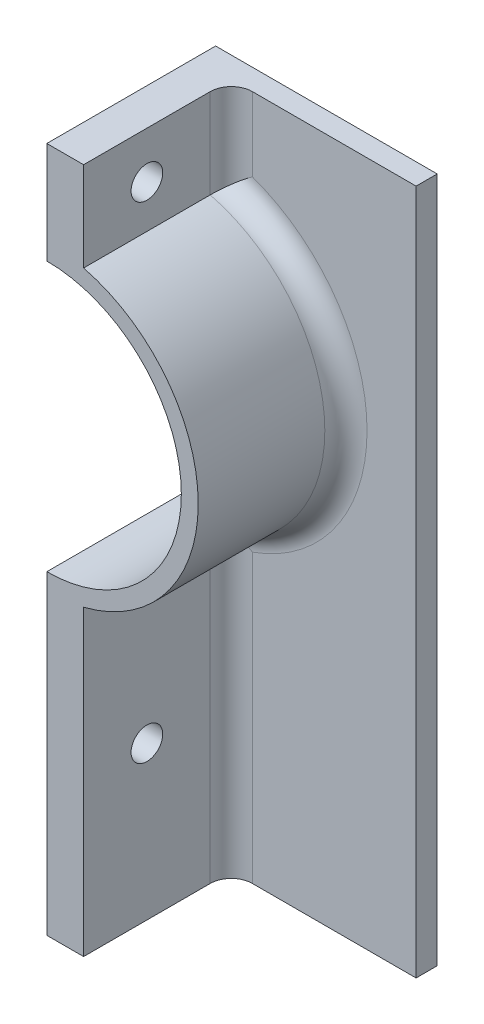
ISO-10303-21;
HEADER;
FILE_DESCRIPTION(('STEP AP214'),'2;1');
FILE_NAME('part.step','',(''),(''),'','','');
FILE_SCHEMA(('AUTOMOTIVE_DESIGN { 1 0 10303 214 1 1 1 1 }'));
ENDSEC;
DATA;
#1=APPLICATION_CONTEXT('core data for automotive mechanical design processes');
#2=APPLICATION_PROTOCOL_DEFINITION('international standard','automotive_design',2000,#1);
#3=PRODUCT_CONTEXT('',#1,'mechanical');
#4=PRODUCT('Part','Part','',(#3));
#5=PRODUCT_RELATED_PRODUCT_CATEGORY('part','',(#4));
#6=PRODUCT_DEFINITION_FORMATION('','',#4);
#7=PRODUCT_DEFINITION_CONTEXT('part definition',#1,'design');
#8=PRODUCT_DEFINITION('design','',#6,#7);
#9=PRODUCT_DEFINITION_SHAPE('','',#8);
#10=(LENGTH_UNIT() NAMED_UNIT(*) SI_UNIT(.MILLI.,.METRE.));
#11=(NAMED_UNIT(*) PLANE_ANGLE_UNIT() SI_UNIT($,.RADIAN.));
#12=(NAMED_UNIT(*) SI_UNIT($,.STERADIAN.) SOLID_ANGLE_UNIT());
#13=UNCERTAINTY_MEASURE_WITH_UNIT(LENGTH_MEASURE(1.E-05),#10,'distance_accuracy_value','');
#14=(GEOMETRIC_REPRESENTATION_CONTEXT(3) GLOBAL_UNCERTAINTY_ASSIGNED_CONTEXT((#13)) GLOBAL_UNIT_ASSIGNED_CONTEXT((#10,
#11,#12)) REPRESENTATION_CONTEXT('',''));
#15=CARTESIAN_POINT('',(0.,0.,0.));
#16=DIRECTION('',(0.,0.,1.));
#17=DIRECTION('',(1.,0.,0.));
#18=AXIS2_PLACEMENT_3D('',#15,#16,#17);
#19=CARTESIAN_POINT('',(28.5577576169837,0.,20.32));
#20=DIRECTION('',(-1.,0.,0.));
#21=DIRECTION('',(0.,0.,1.));
#22=AXIS2_PLACEMENT_3D('',#19,#20,#21);
#23=PLANE('',#22);
#24=CARTESIAN_POINT('',(28.5577576169837,18.4308896178761,12.7));
#25=DIRECTION('',(-1.,0.,0.));
#26=DIRECTION('',(0.,0.,1.));
#27=AXIS2_PLACEMENT_3D('',#24,#25,#26);
#28=CIRCLE('',#27,1.905);
#29=CARTESIAN_POINT('',(28.5577576169837,18.4308896178761,14.605));
#30=VERTEX_POINT('',#29);
#31=EDGE_CURVE('E345',#30,#30,#28,.F.);
#32=ORIENTED_EDGE('',*,*,#31,.F.);
#33=EDGE_LOOP('',(#32));
#34=FACE_BOUND('',#33,.T.);
#35=DIRECTION('',(0.,0.,-1.));
#36=VECTOR('',#35,1.);
#37=CARTESIAN_POINT('',(28.5577576169837,0.,20.32));
#38=LINE('',#37,#36);
#39=CARTESIAN_POINT('',(28.5577576169837,0.,20.32));
#40=VERTEX_POINT('',#39);
#41=CARTESIAN_POINT('',(28.5577576169837,0.,5.08));
#42=VERTEX_POINT('',#41);
#43=EDGE_CURVE('E206',#40,#42,#38,.T.);
#44=ORIENTED_EDGE('',*,*,#43,.T.);
#45=DIRECTION('',(0.,1.,0.));
#46=VECTOR('',#45,1.);
#47=CARTESIAN_POINT('',(28.5577576169837,0.,5.08));
#48=LINE('',#47,#46);
#49=CARTESIAN_POINT('',(28.5577576169837,36.4235565522515,5.08));
#50=VERTEX_POINT('',#49);
#51=EDGE_CURVE('E244',#42,#50,#48,.T.);
#52=ORIENTED_EDGE('',*,*,#51,.T.);
#53=DIRECTION('',(0.,0.,-1.));
#54=VECTOR('',#53,1.);
#55=CARTESIAN_POINT('',(28.5577576169837,36.4235565522515,20.32));
#56=LINE('',#55,#54);
#57=CARTESIAN_POINT('',(28.5577576169837,36.4235565522515,20.32));
#58=VERTEX_POINT('',#57);
#59=EDGE_CURVE('E241',#58,#50,#56,.T.);
#60=ORIENTED_EDGE('',*,*,#59,.F.);
#61=DIRECTION('',(0.,1.,0.));
#62=VECTOR('',#61,1.);
#63=CARTESIAN_POINT('',(28.5577576169837,0.,20.32));
#64=LINE('',#63,#62);
#65=EDGE_CURVE('E179',#40,#58,#64,.T.);
#66=ORIENTED_EDGE('',*,*,#65,.F.);
#67=EDGE_LOOP('',(#44,#52,#60,#66));
#68=FACE_BOUND('',#67,.T.);
#69=ADVANCED_FACE('F45',(#34,#68),#23,.F.);
#70=CARTESIAN_POINT('',(24.13,54.102,20.32));
#71=DIRECTION('',(0.,0.,-1.));
#72=DIRECTION('',(-1.,0.,0.));
#73=AXIS2_PLACEMENT_3D('',#70,#71,#72);
#74=CYLINDRICAL_SURFACE('',#73,18.2245);
#75=ORIENTED_EDGE('',*,*,#59,.T.);
#76=CARTESIAN_POINT('',(24.13,54.102,5.08));
#77=DIRECTION('',(0.,0.,1.));
#78=DIRECTION('',(1.,0.,0.));
#79=AXIS2_PLACEMENT_3D('',#76,#77,#78);
#80=CIRCLE('',#79,18.2245);
#81=CARTESIAN_POINT('',(28.5577576169837,71.7804434477485,5.08));
#82=VERTEX_POINT('',#81);
#83=EDGE_CURVE('E64',#50,#82,#80,.T.);
#84=ORIENTED_EDGE('',*,*,#83,.T.);
#85=DIRECTION('',(0.,0.,-1.));
#86=VECTOR('',#85,1.);
#87=CARTESIAN_POINT('',(28.5577576169837,71.7804434477485,20.32));
#88=LINE('',#87,#86);
#89=CARTESIAN_POINT('',(28.5577576169837,71.7804434477485,20.32));
#90=VERTEX_POINT('',#89);
#91=EDGE_CURVE('E238',#90,#82,#88,.T.);
#92=ORIENTED_EDGE('',*,*,#91,.F.);
#93=CARTESIAN_POINT('',(24.13,54.102,20.32));
#94=DIRECTION('',(0.,0.,1.));
#95=DIRECTION('',(1.,0.,0.));
#96=AXIS2_PLACEMENT_3D('',#93,#94,#95);
#97=CIRCLE('',#96,18.2245);
#98=EDGE_CURVE('E183',#58,#90,#97,.T.);
#99=ORIENTED_EDGE('',*,*,#98,.F.);
#100=EDGE_LOOP('',(#75,#84,#92,#99));
#101=FACE_BOUND('',#100,.T.);
#102=ADVANCED_FACE('F292',(#101),#74,.T.);
#103=CARTESIAN_POINT('',(28.5577576169837,0.,20.32));
#104=DIRECTION('',(1.,0.,0.));
#105=DIRECTION('',(0.,0.,-1.));
#106=AXIS2_PLACEMENT_3D('',#103,#104,#105);
#107=PLANE('',#106);
#108=CARTESIAN_POINT('',(28.5577576169837,76.9461103821239,12.7));
#109=DIRECTION('',(1.,0.,0.));
#110=DIRECTION('',(0.,0.,-1.));
#111=AXIS2_PLACEMENT_3D('',#108,#109,#110);
#112=CIRCLE('',#111,1.905);
#113=CARTESIAN_POINT('',(28.5577576169837,76.9461103821239,10.795));
#114=VERTEX_POINT('',#113);
#115=EDGE_CURVE('E270',#114,#114,#112,.F.);
#116=ORIENTED_EDGE('',*,*,#115,.T.);
#117=EDGE_LOOP('',(#116));
#118=FACE_BOUND('',#117,.T.);
#119=ORIENTED_EDGE('',*,*,#91,.T.);
#120=DIRECTION('',(0.,-1.,0.));
#121=VECTOR('',#120,1.);
#122=CARTESIAN_POINT('',(28.5577576169837,82.55,5.08));
#123=LINE('',#122,#121);
#124=CARTESIAN_POINT('',(28.5577576169837,82.55,5.08));
#125=VERTEX_POINT('',#124);
#126=EDGE_CURVE('E71',#82,#125,#123,.F.);
#127=ORIENTED_EDGE('',*,*,#126,.T.);
#128=DIRECTION('',(0.,0.,-1.));
#129=VECTOR('',#128,1.);
#130=CARTESIAN_POINT('',(28.5577576169837,82.55,20.32));
#131=LINE('',#130,#129);
#132=CARTESIAN_POINT('',(28.5577576169837,82.55,20.32));
#133=VERTEX_POINT('',#132);
#134=EDGE_CURVE('E235',#133,#125,#131,.T.);
#135=ORIENTED_EDGE('',*,*,#134,.F.);
#136=DIRECTION('',(0.,-1.,0.));
#137=VECTOR('',#136,1.);
#138=CARTESIAN_POINT('',(28.5577576169837,0.,20.32));
#139=LINE('',#138,#137);
#140=EDGE_CURVE('E186',#133,#90,#139,.T.);
#141=ORIENTED_EDGE('',*,*,#140,.T.);
#142=EDGE_LOOP('',(#119,#127,#135,#141));
#143=FACE_BOUND('',#142,.T.);
#144=ADVANCED_FACE('F297',(#118,#143),#107,.T.);
#145=CARTESIAN_POINT('',(0.,82.55,20.32));
#146=DIRECTION('',(0.,1.,0.));
#147=DIRECTION('',(0.,0.,1.));
#148=AXIS2_PLACEMENT_3D('',#145,#146,#147);
#149=PLANE('',#148);
#150=DIRECTION('',(1.,0.,0.));
#151=VECTOR('',#150,1.);
#152=CARTESIAN_POINT('',(0.,82.55,0.));
#153=LINE('',#152,#151);
#154=CARTESIAN_POINT('',(24.13,82.55,0.));
#155=VERTEX_POINT('',#154);
#156=CARTESIAN_POINT('',(50.8,82.55,0.));
#157=VERTEX_POINT('',#156);
#158=EDGE_CURVE('E151',#155,#157,#153,.T.);
#159=ORIENTED_EDGE('',*,*,#158,.F.);
#160=DIRECTION('',(0.,0.,-1.));
#161=VECTOR('',#160,1.);
#162=CARTESIAN_POINT('',(24.13,82.55,20.32));
#163=LINE('',#162,#161);
#164=CARTESIAN_POINT('',(24.13,82.55,20.32));
#165=VERTEX_POINT('',#164);
#166=EDGE_CURVE('E232',#165,#155,#163,.T.);
#167=ORIENTED_EDGE('',*,*,#166,.F.);
#168=DIRECTION('',(1.,0.,0.));
#169=VECTOR('',#168,1.);
#170=CARTESIAN_POINT('',(0.,82.55,20.32));
#171=LINE('',#170,#169);
#172=EDGE_CURVE('E190',#165,#133,#171,.T.);
#173=ORIENTED_EDGE('',*,*,#172,.T.);
#174=ORIENTED_EDGE('',*,*,#134,.T.);
#175=CARTESIAN_POINT('',(31.0977576169837,82.55,5.08));
#176=DIRECTION('',(0.,1.,0.));
#177=DIRECTION('',(0.,0.,1.));
#178=AXIS2_PLACEMENT_3D('',#175,#176,#177);
#179=CIRCLE('',#178,2.54);
#180=CARTESIAN_POINT('',(31.0977576169837,82.55,2.54));
#181=VERTEX_POINT('',#180);
#182=EDGE_CURVE('E11',#125,#181,#179,.F.);
#183=ORIENTED_EDGE('',*,*,#182,.T.);
#184=DIRECTION('',(1.,0.,0.));
#185=VECTOR('',#184,1.);
#186=CARTESIAN_POINT('',(0.,82.55,2.54));
#187=LINE('',#186,#185);
#188=CARTESIAN_POINT('',(50.8,82.55,2.54));
#189=VERTEX_POINT('',#188);
#190=EDGE_CURVE('E168',#181,#189,#187,.T.);
#191=ORIENTED_EDGE('',*,*,#190,.T.);
#192=DIRECTION('',(0.,0.,-1.));
#193=VECTOR('',#192,1.);
#194=CARTESIAN_POINT('',(50.8,82.55,2.54));
#195=LINE('',#194,#193);
#196=EDGE_CURVE('E152',#189,#157,#195,.T.);
#197=ORIENTED_EDGE('',*,*,#196,.T.);
#198=EDGE_LOOP('',(#159,#167,#173,#174,#183,#191,#197));
#199=FACE_BOUND('',#198,.T.);
#200=ADVANCED_FACE('F304',(#199),#149,.T.);
#201=CARTESIAN_POINT('',(24.13,0.,20.32));
#202=DIRECTION('',(1.,0.,0.));
#203=DIRECTION('',(0.,0.,-1.));
#204=AXIS2_PLACEMENT_3D('',#201,#202,#203);
#205=PLANE('',#204);
#206=CARTESIAN_POINT('',(24.13,76.9461103821239,12.7));
#207=DIRECTION('',(1.,0.,0.));
#208=DIRECTION('',(0.,0.,-1.));
#209=AXIS2_PLACEMENT_3D('',#206,#207,#208);
#210=CIRCLE('',#209,1.905);
#211=CARTESIAN_POINT('',(24.13,76.9461103821239,10.795));
#212=VERTEX_POINT('',#211);
#213=EDGE_CURVE('E50',#212,#212,#210,.F.);
#214=ORIENTED_EDGE('',*,*,#213,.F.);
#215=EDGE_LOOP('',(#214));
#216=FACE_BOUND('',#215,.T.);
#217=DIRECTION('',(0.,-1.,0.));
#218=VECTOR('',#217,1.);
#219=CARTESIAN_POINT('',(24.13,0.,0.));
#220=LINE('',#219,#218);
#221=CARTESIAN_POINT('',(24.13,70.2945,0.));
#222=VERTEX_POINT('',#221);
#223=EDGE_CURVE('E209',#155,#222,#220,.T.);
#224=ORIENTED_EDGE('',*,*,#223,.T.);
#225=DIRECTION('',(0.,0.,-1.));
#226=VECTOR('',#225,1.);
#227=CARTESIAN_POINT('',(24.13,70.2945,20.32));
#228=LINE('',#227,#226);
#229=CARTESIAN_POINT('',(24.13,70.2945,20.32));
#230=VERTEX_POINT('',#229);
#231=EDGE_CURVE('E229',#230,#222,#228,.T.);
#232=ORIENTED_EDGE('',*,*,#231,.F.);
#233=DIRECTION('',(0.,-1.,0.));
#234=VECTOR('',#233,1.);
#235=CARTESIAN_POINT('',(24.13,0.,20.32));
#236=LINE('',#235,#234);
#237=EDGE_CURVE('E194',#165,#230,#236,.T.);
#238=ORIENTED_EDGE('',*,*,#237,.F.);
#239=ORIENTED_EDGE('',*,*,#166,.T.);
#240=EDGE_LOOP('',(#224,#232,#238,#239));
#241=FACE_BOUND('',#240,.T.);
#242=ADVANCED_FACE('F308',(#216,#241),#205,.F.);
#243=CARTESIAN_POINT('',(24.13,54.102,20.32));
#244=DIRECTION('',(0.,0.,-1.));
#245=DIRECTION('',(-1.,0.,0.));
#246=AXIS2_PLACEMENT_3D('',#243,#244,#245);
#247=CYLINDRICAL_SURFACE('',#246,16.1925);
#248=CARTESIAN_POINT('',(24.13,54.102,0.));
#249=DIRECTION('',(0.,0.,1.));
#250=DIRECTION('',(1.,0.,0.));
#251=AXIS2_PLACEMENT_3D('',#248,#249,#250);
#252=CIRCLE('',#251,16.1925);
#253=CARTESIAN_POINT('',(24.13,37.9095,0.));
#254=VERTEX_POINT('',#253);
#255=EDGE_CURVE('E213',#254,#222,#252,.T.);
#256=ORIENTED_EDGE('',*,*,#255,.F.);
#257=DIRECTION('',(0.,0.,-1.));
#258=VECTOR('',#257,1.);
#259=CARTESIAN_POINT('',(24.13,37.9095,20.32));
#260=LINE('',#259,#258);
#261=CARTESIAN_POINT('',(24.13,37.9095,20.32));
#262=VERTEX_POINT('',#261);
#263=EDGE_CURVE('E226',#262,#254,#260,.T.);
#264=ORIENTED_EDGE('',*,*,#263,.F.);
#265=CARTESIAN_POINT('',(24.13,54.102,20.32));
#266=DIRECTION('',(0.,0.,1.));
#267=DIRECTION('',(1.,0.,0.));
#268=AXIS2_PLACEMENT_3D('',#265,#266,#267);
#269=CIRCLE('',#268,16.1925);
#270=EDGE_CURVE('E197',#262,#230,#269,.T.);
#271=ORIENTED_EDGE('',*,*,#270,.T.);
#272=ORIENTED_EDGE('',*,*,#231,.T.);
#273=EDGE_LOOP('',(#256,#264,#271,#272));
#274=FACE_BOUND('',#273,.T.);
#275=ADVANCED_FACE('F310',(#274),#247,.F.);
#276=CARTESIAN_POINT('',(24.13,18.4308896178761,12.7));
#277=DIRECTION('',(1.,0.,0.));
#278=DIRECTION('',(0.,0.,-1.));
#279=AXIS2_PLACEMENT_3D('',#276,#277,#278);
#280=CIRCLE('',#279,1.905);
#281=CARTESIAN_POINT('',(24.13,18.4308896178761,10.795));
#282=VERTEX_POINT('',#281);
#283=EDGE_CURVE('E343',#282,#282,#280,.F.);
#284=ORIENTED_EDGE('',*,*,#283,.F.);
#285=EDGE_LOOP('',(#284));
#286=FACE_BOUND('',#285,.T.);
#287=CARTESIAN_POINT('',(24.13,0.,0.));
#288=VERTEX_POINT('',#287);
#289=EDGE_CURVE('E214',#254,#288,#220,.T.);
#290=ORIENTED_EDGE('',*,*,#289,.T.);
#291=DIRECTION('',(0.,0.,-1.));
#292=VECTOR('',#291,1.);
#293=CARTESIAN_POINT('',(24.13,0.,20.32));
#294=LINE('',#293,#292);
#295=CARTESIAN_POINT('',(24.13,0.,20.32));
#296=VERTEX_POINT('',#295);
#297=EDGE_CURVE('E223',#296,#288,#294,.T.);
#298=ORIENTED_EDGE('',*,*,#297,.F.);
#299=EDGE_CURVE('E198',#262,#296,#236,.T.);
#300=ORIENTED_EDGE('',*,*,#299,.F.);
#301=ORIENTED_EDGE('',*,*,#263,.T.);
#302=EDGE_LOOP('',(#290,#298,#300,#301));
#303=FACE_BOUND('',#302,.T.);
#304=ADVANCED_FACE('F313',(#286,#303),#205,.F.);
#305=CARTESIAN_POINT('',(0.,0.,20.32));
#306=DIRECTION('',(0.,-1.,0.));
#307=DIRECTION('',(0.,0.,-1.));
#308=AXIS2_PLACEMENT_3D('',#305,#306,#307);
#309=PLANE('',#308);
#310=DIRECTION('',(-1.,0.,0.));
#311=VECTOR('',#310,1.);
#312=CARTESIAN_POINT('',(0.,0.,0.));
#313=LINE('',#312,#311);
#314=CARTESIAN_POINT('',(50.8,0.,0.));
#315=VERTEX_POINT('',#314);
#316=EDGE_CURVE('E145',#315,#288,#313,.T.);
#317=ORIENTED_EDGE('',*,*,#316,.F.);
#318=DIRECTION('',(0.,0.,-1.));
#319=VECTOR('',#318,1.);
#320=CARTESIAN_POINT('',(50.8,0.,2.54));
#321=LINE('',#320,#319);
#322=CARTESIAN_POINT('',(50.8,0.,2.54));
#323=VERTEX_POINT('',#322);
#324=EDGE_CURVE('E139',#323,#315,#321,.T.);
#325=ORIENTED_EDGE('',*,*,#324,.F.);
#326=DIRECTION('',(-1.,0.,0.));
#327=VECTOR('',#326,1.);
#328=CARTESIAN_POINT('',(0.,0.,2.54));
#329=LINE('',#328,#327);
#330=CARTESIAN_POINT('',(31.0977576169837,0.,2.54));
#331=VERTEX_POINT('',#330);
#332=EDGE_CURVE('E142',#323,#331,#329,.T.);
#333=ORIENTED_EDGE('',*,*,#332,.T.);
#334=CARTESIAN_POINT('',(31.0977576169837,0.,5.08));
#335=DIRECTION('',(0.,-1.,0.));
#336=DIRECTION('',(0.,0.,-1.));
#337=AXIS2_PLACEMENT_3D('',#334,#335,#336);
#338=CIRCLE('',#337,2.54);
#339=EDGE_CURVE('E56',#331,#42,#338,.F.);
#340=ORIENTED_EDGE('',*,*,#339,.T.);
#341=ORIENTED_EDGE('',*,*,#43,.F.);
#342=DIRECTION('',(-1.,0.,0.));
#343=VECTOR('',#342,1.);
#344=CARTESIAN_POINT('',(0.,0.,20.32));
#345=LINE('',#344,#343);
#346=EDGE_CURVE('E202',#40,#296,#345,.T.);
#347=ORIENTED_EDGE('',*,*,#346,.T.);
#348=ORIENTED_EDGE('',*,*,#297,.T.);
#349=EDGE_LOOP('',(#317,#325,#333,#340,#341,#347,#348));
#350=FACE_BOUND('',#349,.T.);
#351=ADVANCED_FACE('F141',(#350),#309,.T.);
#352=CARTESIAN_POINT('',(0.,0.,20.32));
#353=DIRECTION('',(0.,0.,1.));
#354=DIRECTION('',(1.,0.,0.));
#355=AXIS2_PLACEMENT_3D('',#352,#353,#354);
#356=PLANE('',#355);
#357=ORIENTED_EDGE('',*,*,#65,.T.);
#358=ORIENTED_EDGE('',*,*,#98,.T.);
#359=ORIENTED_EDGE('',*,*,#140,.F.);
#360=ORIENTED_EDGE('',*,*,#172,.F.);
#361=ORIENTED_EDGE('',*,*,#237,.T.);
#362=ORIENTED_EDGE('',*,*,#270,.F.);
#363=ORIENTED_EDGE('',*,*,#299,.T.);
#364=ORIENTED_EDGE('',*,*,#346,.F.);
#365=EDGE_LOOP('',(#357,#358,#359,#360,#361,#362,#363,#364));
#366=FACE_BOUND('',#365,.T.);
#367=ADVANCED_FACE('F320',(#366),#356,.T.);
#368=CARTESIAN_POINT('',(0.,0.,0.));
#369=DIRECTION('',(0.,0.,1.));
#370=DIRECTION('',(1.,0.,0.));
#371=AXIS2_PLACEMENT_3D('',#368,#369,#370);
#372=PLANE('',#371);
#373=DIRECTION('',(0.,-1.,0.));
#374=VECTOR('',#373,1.);
#375=CARTESIAN_POINT('',(50.8,0.,0.));
#376=LINE('',#375,#374);
#377=EDGE_CURVE('E162',#157,#315,#376,.T.);
#378=ORIENTED_EDGE('',*,*,#377,.T.);
#379=ORIENTED_EDGE('',*,*,#316,.T.);
#380=ORIENTED_EDGE('',*,*,#289,.F.);
#381=ORIENTED_EDGE('',*,*,#255,.T.);
#382=ORIENTED_EDGE('',*,*,#223,.F.);
#383=ORIENTED_EDGE('',*,*,#158,.T.);
#384=EDGE_LOOP('',(#378,#379,#380,#381,#382,#383));
#385=FACE_BOUND('',#384,.T.);
#386=ADVANCED_FACE('F321',(#385),#372,.F.);
#387=CARTESIAN_POINT('',(50.8,0.,2.54));
#388=DIRECTION('',(1.,0.,0.));
#389=DIRECTION('',(0.,0.,-1.));
#390=AXIS2_PLACEMENT_3D('',#387,#388,#389);
#391=PLANE('',#390);
#392=ORIENTED_EDGE('',*,*,#377,.F.);
#393=ORIENTED_EDGE('',*,*,#196,.F.);
#394=DIRECTION('',(0.,-1.,0.));
#395=VECTOR('',#394,1.);
#396=CARTESIAN_POINT('',(50.8,0.,2.54));
#397=LINE('',#396,#395);
#398=EDGE_CURVE('E158',#189,#323,#397,.T.);
#399=ORIENTED_EDGE('',*,*,#398,.T.);
#400=ORIENTED_EDGE('',*,*,#324,.T.);
#401=EDGE_LOOP('',(#392,#393,#399,#400));
#402=FACE_BOUND('',#401,.T.);
#403=ADVANCED_FACE('F165',(#402),#391,.T.);
#404=CARTESIAN_POINT('',(0.,0.,2.54));
#405=DIRECTION('',(0.,0.,1.));
#406=DIRECTION('',(1.,0.,0.));
#407=AXIS2_PLACEMENT_3D('',#404,#405,#406);
#408=PLANE('',#407);
#409=CARTESIAN_POINT('',(24.13,54.102,2.54));
#410=DIRECTION('',(0.,0.,1.));
#411=DIRECTION('',(1.,0.,0.));
#412=AXIS2_PLACEMENT_3D('',#409,#410,#411);
#413=CIRCLE('',#412,20.7645);
#414=CARTESIAN_POINT('',(31.0977576169837,73.6625422736939,2.54));
#415=VERTEX_POINT('',#414);
#416=CARTESIAN_POINT('',(31.0977576169837,34.5414577263061,2.54));
#417=VERTEX_POINT('',#416);
#418=EDGE_CURVE('E248',#415,#417,#413,.F.);
#419=ORIENTED_EDGE('',*,*,#418,.T.);
#420=DIRECTION('',(0.,1.,0.));
#421=VECTOR('',#420,1.);
#422=CARTESIAN_POINT('',(31.0977576169837,0.,2.54));
#423=LINE('',#422,#421);
#424=EDGE_CURVE('E160',#417,#331,#423,.F.);
#425=ORIENTED_EDGE('',*,*,#424,.T.);
#426=ORIENTED_EDGE('',*,*,#332,.F.);
#427=ORIENTED_EDGE('',*,*,#398,.F.);
#428=ORIENTED_EDGE('',*,*,#190,.F.);
#429=DIRECTION('',(0.,-1.,0.));
#430=VECTOR('',#429,1.);
#431=CARTESIAN_POINT('',(31.0977576169837,71.7804434477485,2.54));
#432=LINE('',#431,#430);
#433=EDGE_CURVE('E251',#181,#415,#432,.T.);
#434=ORIENTED_EDGE('',*,*,#433,.T.);
#435=EDGE_LOOP('',(#419,#425,#426,#427,#428,#434));
#436=FACE_BOUND('',#435,.T.);
#437=ADVANCED_FACE('F156',(#436),#408,.T.);
#438=CARTESIAN_POINT('',(31.0977576169837,0.,5.08));
#439=DIRECTION('',(0.,1.,0.));
#440=DIRECTION('',(0.,0.,1.));
#441=AXIS2_PLACEMENT_3D('',#438,#439,#440);
#442=CYLINDRICAL_SURFACE('',#441,2.54);
#443=ORIENTED_EDGE('',*,*,#182,.F.);
#444=ORIENTED_EDGE('',*,*,#126,.F.);
#445=CARTESIAN_POINT('',(28.5577576169837,71.7804434477485,5.08));
#446=CARTESIAN_POINT('',(28.5577447177673,71.7804323594244,5.01897538217353));
#447=CARTESIAN_POINT('',(28.5599564190927,71.7821594311123,4.95795962402907));
#448=CARTESIAN_POINT('',(28.5687298571078,71.7890050134928,4.83646639805687));
#449=CARTESIAN_POINT('',(28.5752891581195,71.7941216252449,4.77598864803288));
#450=CARTESIAN_POINT('',(28.5926036205953,71.8076185419404,4.65640393504167));
#451=CARTESIAN_POINT('',(28.6033318424013,71.8159778916477,4.59729070176332));
#452=CARTESIAN_POINT('',(28.6287998145313,71.8358028276662,4.48047851498156));
#453=CARTESIAN_POINT('',(28.6435399310336,71.8472686975188,4.4227796911));
#454=CARTESIAN_POINT('',(28.6933968473924,71.8860038001657,4.25261593225714));
#455=CARTESIAN_POINT('',(28.7342016233491,71.9176507836429,4.14273999892197));
#456=CARTESIAN_POINT('',(28.8288947782151,71.990832116669,3.93229095749426));
#457=CARTESIAN_POINT('',(28.8828026079446,72.0323811635246,3.83173198935096));
#458=CARTESIAN_POINT('',(29.0061574795215,72.1270570924151,3.63381837993295));
#459=CARTESIAN_POINT('',(29.076490967915,72.1808359500861,3.53733176574616));
#460=CARTESIAN_POINT('',(29.2273020954083,72.295562693126,3.35756508763328));
#461=CARTESIAN_POINT('',(29.3077817719582,72.3565120182276,3.27428768384698));
#462=CARTESIAN_POINT('',(29.4940076506455,72.4967714004857,3.10555862836759));
#463=CARTESIAN_POINT('',(29.6015628356559,72.5772938948771,3.02311284318055));
#464=CARTESIAN_POINT('',(29.8253944879477,72.7436959503615,2.87760468717861));
#465=CARTESIAN_POINT('',(29.9416816048966,72.829582030805,2.81456648008226));
#466=CARTESIAN_POINT('',(30.203992797989,73.0219284313884,2.69729218533377));
#467=CARTESIAN_POINT('',(30.3513611590939,73.1291079738015,2.64723846659538));
#468=CARTESIAN_POINT('',(30.6511398462232,73.3452515268356,2.57483512814307));
#469=CARTESIAN_POINT('',(30.8035410077709,73.4542121292311,2.55243772608442));
#470=CARTESIAN_POINT('',(31.000850310934,73.5940956209175,2.54146439184898));
#471=CARTESIAN_POINT('',(31.0450412318971,73.6253490881909,2.54016191801443));
#472=CARTESIAN_POINT('',(31.0921000090655,73.6585514565979,2.54000472801651));
#473=CARTESIAN_POINT('',(31.094928736031,73.6605469630467,2.5400000023258));
#474=CARTESIAN_POINT('',(31.0977576169837,73.6625422736939,2.54));
#475=B_SPLINE_CURVE_WITH_KNOTS('',3,(#445,#446,#447,#448,#449,#450,#451,#452,#453,#454,#455,
#456,#457,#458,#459,#460,#461,#462,#463,#464,#465,#466,#467,#468,#469,#470,#471,#472,#473,#474),
.UNSPECIFIED.,.F.,.F.,(4,2,2,2,2,2,2,2,2,2,2,2,2,2,4),(0.,0.182994816607482,0.365887199646657,
0.547616871590239,0.729363136136367,1.09181975379095,1.4548177416821,1.84625019823648,
2.23776138369367,2.70894042088297,3.18070375654704,3.74543113503546,4.30918145189486,
4.47157553584164,4.48196080013805),.UNSPECIFIED.);
#476=EDGE_CURVE('E176',#415,#82,#475,.F.);
#477=ORIENTED_EDGE('',*,*,#476,.F.);
#478=ORIENTED_EDGE('',*,*,#433,.F.);
#479=EDGE_LOOP('',(#443,#444,#477,#478));
#480=FACE_BOUND('',#479,.T.);
#481=ADVANCED_FACE('F47',(#480),#442,.F.);
#482=CARTESIAN_POINT('',(24.13,54.102,5.08));
#483=DIRECTION('',(0.,0.,1.));
#484=DIRECTION('',(1.,0.,0.));
#485=AXIS2_PLACEMENT_3D('',#482,#483,#484);
#486=TOROIDAL_SURFACE('',#485,20.7645,2.54);
#487=ORIENTED_EDGE('',*,*,#476,.T.);
#488=ORIENTED_EDGE('',*,*,#83,.F.);
#489=CARTESIAN_POINT('',(28.5577576169837,36.4235565522515,5.08));
#490=CARTESIAN_POINT('',(28.5577447177673,36.4235676405756,5.01897538217353));
#491=CARTESIAN_POINT('',(28.5599564190927,36.4218405688876,4.95795962402907));
#492=CARTESIAN_POINT('',(28.5687298571079,36.4149949865072,4.83646639805687));
#493=CARTESIAN_POINT('',(28.5752891581195,36.4098783747551,4.77598864803288));
#494=CARTESIAN_POINT('',(28.5926036205953,36.3963814580596,4.65640393504167));
#495=CARTESIAN_POINT('',(28.6033318424013,36.3880221083523,4.59729070176332));
#496=CARTESIAN_POINT('',(28.6287998145313,36.3681971723338,4.48047851498156));
#497=CARTESIAN_POINT('',(28.6435399310336,36.3567313024812,4.4227796911));
#498=CARTESIAN_POINT('',(28.6933968473924,36.3179961998343,4.25261593225715));
#499=CARTESIAN_POINT('',(28.7342016233491,36.2863492163571,4.14273999892197));
#500=CARTESIAN_POINT('',(28.8288947782151,36.213167883331,3.93229095749426));
#501=CARTESIAN_POINT('',(28.8828026079446,36.1716188364754,3.83173198935096));
#502=CARTESIAN_POINT('',(29.0061574795215,36.0769429075849,3.63381837993295));
#503=CARTESIAN_POINT('',(29.076490967915,36.0231640499139,3.53733176574616));
#504=CARTESIAN_POINT('',(29.2273020954083,35.908437306874,3.35756508763328));
#505=CARTESIAN_POINT('',(29.3077817719582,35.8474879817724,3.27428768384699));
#506=CARTESIAN_POINT('',(29.4940076506455,35.7072285995143,3.1055586283676));
#507=CARTESIAN_POINT('',(29.6015628356559,35.6267061051229,3.02311284318055));
#508=CARTESIAN_POINT('',(29.8253944879476,35.4603040496385,2.87760468717861));
#509=CARTESIAN_POINT('',(29.9416816048965,35.374417969195,2.81456648008226));
#510=CARTESIAN_POINT('',(30.203992797989,35.1820715686116,2.69729218533377));
#511=CARTESIAN_POINT('',(30.3513611590941,35.0748920261987,2.64723846659538));
#512=CARTESIAN_POINT('',(30.651139846223,34.8587484731642,2.57483512814307));
#513=CARTESIAN_POINT('',(30.8035410077702,34.7497878707679,2.55243772608442));
#514=CARTESIAN_POINT('',(31.0008503109342,34.6099043790828,2.54146439184899));
#515=CARTESIAN_POINT('',(31.0450412318976,34.5786509118098,2.54016191801443));
#516=CARTESIAN_POINT('',(31.0921000090656,34.5454485434022,2.54000472801651));
#517=CARTESIAN_POINT('',(31.094928736031,34.5434530369533,2.5400000023258));
#518=CARTESIAN_POINT('',(31.0977576169837,34.5414577263061,2.54));
#519=B_SPLINE_CURVE_WITH_KNOTS('',3,(#489,#490,#491,#492,#493,#494,#495,#496,#497,#498,#499,
#500,#501,#502,#503,#504,#505,#506,#507,#508,#509,#510,#511,#512,#513,#514,#515,#516,#517,#518),
.UNSPECIFIED.,.F.,.F.,(4,2,2,2,2,2,2,2,2,2,2,2,2,2,4),(0.,0.182994816607482,0.365887199646658,
0.547616871590238,0.729363136136365,1.09181975379094,1.4548177416821,1.84625019823647,
2.23776138369367,2.70894042088296,3.18070375654704,3.74543113503547,4.30918145189486,
4.47157553584164,4.48196080013805),.UNSPECIFIED.);
#520=EDGE_CURVE('E262',#417,#50,#519,.F.);
#521=ORIENTED_EDGE('',*,*,#520,.F.);
#522=ORIENTED_EDGE('',*,*,#418,.F.);
#523=EDGE_LOOP('',(#487,#488,#521,#522));
#524=FACE_BOUND('',#523,.T.);
#525=ADVANCED_FACE('F278',(#524),#486,.F.);
#526=CARTESIAN_POINT('',(31.0977576169837,0.,5.08));
#527=DIRECTION('',(0.,1.,0.));
#528=DIRECTION('',(0.,0.,1.));
#529=AXIS2_PLACEMENT_3D('',#526,#527,#528);
#530=CYLINDRICAL_SURFACE('',#529,2.54);
#531=ORIENTED_EDGE('',*,*,#339,.F.);
#532=ORIENTED_EDGE('',*,*,#424,.F.);
#533=ORIENTED_EDGE('',*,*,#520,.T.);
#534=ORIENTED_EDGE('',*,*,#51,.F.);
#535=EDGE_LOOP('',(#531,#532,#533,#534));
#536=FACE_BOUND('',#535,.T.);
#537=ADVANCED_FACE('F275',(#536),#530,.F.);
#538=CARTESIAN_POINT('',(50.8,18.4308896178761,12.7));
#539=DIRECTION('',(-1.,0.,0.));
#540=DIRECTION('',(0.,0.,1.));
#541=AXIS2_PLACEMENT_3D('',#538,#539,#540);
#542=CYLINDRICAL_SURFACE('',#541,1.905);
#543=ORIENTED_EDGE('',*,*,#283,.T.);
#544=EDGE_LOOP('',(#543));
#545=FACE_BOUND('',#544,.T.);
#546=ORIENTED_EDGE('',*,*,#31,.T.);
#547=EDGE_LOOP('',(#546));
#548=FACE_BOUND('',#547,.T.);
#549=ADVANCED_FACE('F287',(#545,#548),#542,.F.);
#550=CARTESIAN_POINT('',(50.8,76.9461103821239,12.7));
#551=DIRECTION('',(-1.,0.,0.));
#552=DIRECTION('',(0.,0.,1.));
#553=AXIS2_PLACEMENT_3D('',#550,#551,#552);
#554=CYLINDRICAL_SURFACE('',#553,1.905);
#555=ORIENTED_EDGE('',*,*,#115,.F.);
#556=EDGE_LOOP('',(#555));
#557=FACE_BOUND('',#556,.T.);
#558=ORIENTED_EDGE('',*,*,#213,.T.);
#559=EDGE_LOOP('',(#558));
#560=FACE_BOUND('',#559,.T.);
#561=ADVANCED_FACE('F332',(#557,#560),#554,.F.);
#562=CLOSED_SHELL('',(#69,#102,#144,#200,#242,#275,#304,#351,#367,#386,#403,#437,#481,#525,#537,
#549,#561));
#563=MANIFOLD_SOLID_BREP('B2',#562);
#564=ADVANCED_BREP_SHAPE_REPRESENTATION('',(#18,#563),#14);
#565=SHAPE_DEFINITION_REPRESENTATION(#9,#564);
ENDSEC;
END-ISO-10303-21;
